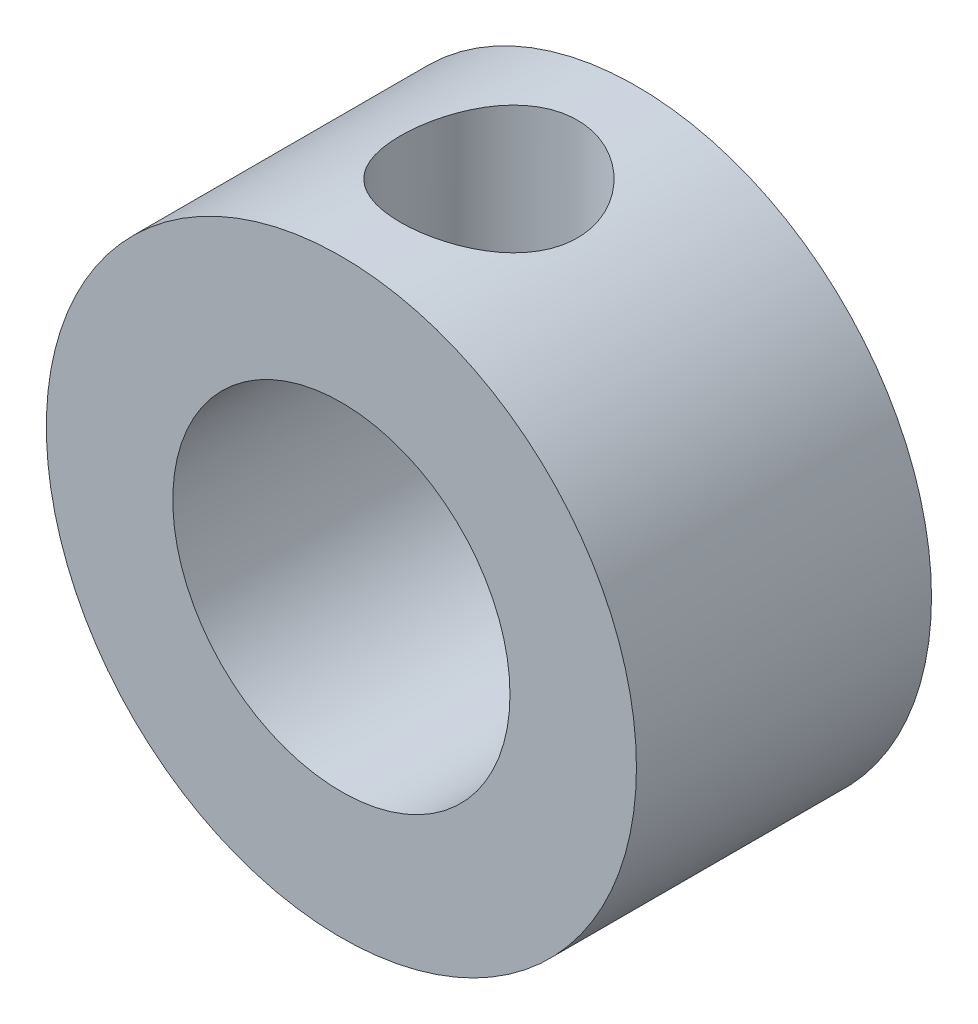
ISO-10303-21;
HEADER;
FILE_DESCRIPTION(('STEP AP214'),'2;1');
FILE_NAME('part.step','',(''),(''),'','','');
FILE_SCHEMA(('AUTOMOTIVE_DESIGN { 1 0 10303 214 1 1 1 1 }'));
ENDSEC;
DATA;
#1=APPLICATION_CONTEXT('core data for automotive mechanical design processes');
#2=APPLICATION_PROTOCOL_DEFINITION('international standard','automotive_design',2000,#1);
#3=PRODUCT_CONTEXT('',#1,'mechanical');
#4=PRODUCT('Part','Part','',(#3));
#5=PRODUCT_RELATED_PRODUCT_CATEGORY('part','',(#4));
#6=PRODUCT_DEFINITION_FORMATION('','',#4);
#7=PRODUCT_DEFINITION_CONTEXT('part definition',#1,'design');
#8=PRODUCT_DEFINITION('design','',#6,#7);
#9=PRODUCT_DEFINITION_SHAPE('','',#8);
#10=(LENGTH_UNIT() NAMED_UNIT(*) SI_UNIT(.MILLI.,.METRE.));
#11=(NAMED_UNIT(*) PLANE_ANGLE_UNIT() SI_UNIT($,.RADIAN.));
#12=(NAMED_UNIT(*) SI_UNIT($,.STERADIAN.) SOLID_ANGLE_UNIT());
#13=UNCERTAINTY_MEASURE_WITH_UNIT(LENGTH_MEASURE(1.E-05),#10,'distance_accuracy_value','');
#14=(GEOMETRIC_REPRESENTATION_CONTEXT(3) GLOBAL_UNCERTAINTY_ASSIGNED_CONTEXT((#13)) GLOBAL_UNIT_ASSIGNED_CONTEXT((#10,
#11,#12)) REPRESENTATION_CONTEXT('',''));
#15=CARTESIAN_POINT('',(0.,0.,0.));
#16=DIRECTION('',(0.,0.,1.));
#17=DIRECTION('',(1.,0.,0.));
#18=AXIS2_PLACEMENT_3D('',#15,#16,#17);
#19=CARTESIAN_POINT('',(0.,0.,7.));
#20=DIRECTION('',(0.,0.,1.));
#21=DIRECTION('',(1.,0.,0.));
#22=AXIS2_PLACEMENT_3D('',#19,#20,#21);
#23=PLANE('',#22);
#24=CARTESIAN_POINT('',(0.,0.,7.));
#25=DIRECTION('',(0.,0.,1.));
#26=DIRECTION('',(1.,0.,0.));
#27=AXIS2_PLACEMENT_3D('',#24,#25,#26);
#28=CIRCLE('',#27,7.);
#29=CARTESIAN_POINT('',(7.,0.,7.));
#30=VERTEX_POINT('',#29);
#31=EDGE_CURVE('E10',#30,#30,#28,.T.);
#32=ORIENTED_EDGE('',*,*,#31,.T.);
#33=EDGE_LOOP('',(#32));
#34=FACE_BOUND('',#33,.T.);
#35=CARTESIAN_POINT('',(0.,0.,7.));
#36=DIRECTION('',(0.,0.,1.));
#37=DIRECTION('',(1.,0.,0.));
#38=AXIS2_PLACEMENT_3D('',#35,#36,#37);
#39=CIRCLE('',#38,4.);
#40=CARTESIAN_POINT('',(4.,0.,7.));
#41=VERTEX_POINT('',#40);
#42=EDGE_CURVE('E48',#41,#41,#39,.T.);
#43=ORIENTED_EDGE('',*,*,#42,.F.);
#44=EDGE_LOOP('',(#43));
#45=FACE_BOUND('',#44,.T.);
#46=ADVANCED_FACE('F36',(#34,#45),#23,.T.);
#47=CARTESIAN_POINT('',(0.,0.,0.));
#48=DIRECTION('',(0.,0.,1.));
#49=DIRECTION('',(1.,0.,0.));
#50=AXIS2_PLACEMENT_3D('',#47,#48,#49);
#51=PLANE('',#50);
#52=CARTESIAN_POINT('',(0.,0.,0.));
#53=DIRECTION('',(0.,0.,1.));
#54=DIRECTION('',(1.,0.,0.));
#55=AXIS2_PLACEMENT_3D('',#52,#53,#54);
#56=CIRCLE('',#55,7.);
#57=CARTESIAN_POINT('',(7.,0.,0.));
#58=VERTEX_POINT('',#57);
#59=EDGE_CURVE('E41',#58,#58,#56,.T.);
#60=ORIENTED_EDGE('',*,*,#59,.F.);
#61=EDGE_LOOP('',(#60));
#62=FACE_BOUND('',#61,.T.);
#63=CARTESIAN_POINT('',(0.,0.,0.));
#64=DIRECTION('',(0.,0.,1.));
#65=DIRECTION('',(1.,0.,0.));
#66=AXIS2_PLACEMENT_3D('',#63,#64,#65);
#67=CIRCLE('',#66,4.);
#68=CARTESIAN_POINT('',(4.,0.,0.));
#69=VERTEX_POINT('',#68);
#70=EDGE_CURVE('E50',#69,#69,#67,.T.);
#71=ORIENTED_EDGE('',*,*,#70,.T.);
#72=EDGE_LOOP('',(#71));
#73=FACE_BOUND('',#72,.T.);
#74=ADVANCED_FACE('F79',(#62,#73),#51,.F.);
#75=CARTESIAN_POINT('',(0.,0.,7.));
#76=DIRECTION('',(0.,0.,-1.));
#77=DIRECTION('',(-1.,0.,0.));
#78=AXIS2_PLACEMENT_3D('',#75,#76,#77);
#79=CYLINDRICAL_SURFACE('',#78,7.);
#80=CARTESIAN_POINT('',(0.,7.,5.59999999999999));
#81=CARTESIAN_POINT('',(-0.115204057854619,6.9999990095077,5.59999860352115));
#82=CARTESIAN_POINT('',(-0.23042224569214,6.99712881971535,5.59048859092644));
#83=CARTESIAN_POINT('',(-0.457503375426832,6.98595947831167,5.55279010408905));
#84=CARTESIAN_POINT('',(-0.569365306175986,6.97765870745569,5.52459605876731));
#85=CARTESIAN_POINT('',(-0.786425790856335,6.95653773502571,5.45055557632562));
#86=CARTESIAN_POINT('',(-0.89163391015352,6.94372420350596,5.40473518253348));
#87=CARTESIAN_POINT('',(-1.09287385347438,6.91490952932704,5.29684946972182));
#88=CARTESIAN_POINT('',(-1.18890445445753,6.89890796268893,5.23478198964641));
#89=CARTESIAN_POINT('',(-1.37182051605724,6.86491032069884,5.09428638953826));
#90=CARTESIAN_POINT('',(-1.45840529974207,6.84687337119851,5.01547672375972));
#91=CARTESIAN_POINT('',(-1.61734889292653,6.81108167894619,4.84454707812574));
#92=CARTESIAN_POINT('',(-1.68970530858417,6.79332698414302,4.75242486302505));
#93=CARTESIAN_POINT('',(-1.8197205281319,6.75967759591281,4.55494094574734));
#94=CARTESIAN_POINT('',(-1.87701232631098,6.74383369329425,4.44932815461296));
#95=CARTESIAN_POINT('',(-1.97289952684664,6.71641068551644,4.22941504407759));
#96=CARTESIAN_POINT('',(-2.01149941887962,6.70483055638635,4.11511681850083));
#97=CARTESIAN_POINT('',(-2.06782287155712,6.68767219173808,3.88445362741736));
#98=CARTESIAN_POINT('',(-2.08610074728548,6.68193497054347,3.76823615859048));
#99=CARTESIAN_POINT('',(-2.1029922286054,6.67663905649674,3.53425358129653));
#100=CARTESIAN_POINT('',(-2.10161059865509,6.677078866648,3.41648885471728));
#101=CARTESIAN_POINT('',(-2.07965768079736,6.68394641694889,3.18726252794812));
#102=CARTESIAN_POINT('',(-2.05978087367759,6.69015744038797,3.07572684949287));
#103=CARTESIAN_POINT('',(-2.00252388597878,6.70751698720074,2.85765229921716));
#104=CARTESIAN_POINT('',(-1.96514197798297,6.71866599785291,2.75111392167594));
#105=CARTESIAN_POINT('',(-1.87342437315154,6.74481826304963,2.54435951047497));
#106=CARTESIAN_POINT('',(-1.81886343708499,6.75987222562333,2.44425008246264));
#107=CARTESIAN_POINT('',(-1.69449311624156,6.7921138180009,2.25437516918573));
#108=CARTESIAN_POINT('',(-1.62468003603623,6.80930196445788,2.16461219882071));
#109=CARTESIAN_POINT('',(-1.46833807071764,6.84475415817112,1.99403933293317));
#110=CARTESIAN_POINT('',(-1.38123287045376,6.86303316034697,1.91375987035847));
#111=CARTESIAN_POINT('',(-1.19456856303955,6.89797141688562,1.76882442231006));
#112=CARTESIAN_POINT('',(-1.09500867260524,6.91463056925774,1.70416942021981));
#113=CARTESIAN_POINT('',(-0.885297053679921,6.94460424097259,1.59199610854938));
#114=CARTESIAN_POINT('',(-0.775078849647127,6.9578956113564,1.5445954772502));
#115=CARTESIAN_POINT('',(-0.547743581844925,6.97946930565111,1.46916057386052));
#116=CARTESIAN_POINT('',(-0.430628452225412,6.98775302661799,1.44112090005452));
#117=CARTESIAN_POINT('',(-0.197333139735663,6.99815710500954,1.40608695094086));
#118=CARTESIAN_POINT('',(-0.0812701366416606,7.00048790584906,1.39837377987775));
#119=CARTESIAN_POINT('',(0.150499448152737,6.99934092538464,1.40219681799692));
#120=CARTESIAN_POINT('',(0.266206075367093,6.9958639194886,1.41373045751203));
#121=CARTESIAN_POINT('',(0.491265047433575,6.98362975782027,1.4551384555561));
#122=CARTESIAN_POINT('',(0.600701881659836,6.9749936171918,1.48459274261322));
#123=CARTESIAN_POINT('',(0.813056494536329,6.95344086978149,1.56050052588949));
#124=CARTESIAN_POINT('',(0.915973487835815,6.94052374849531,1.60695606545301));
#125=CARTESIAN_POINT('',(1.11501206524547,6.91137516091842,1.71675443167359));
#126=CARTESIAN_POINT('',(1.21092135667953,6.89507393161496,1.78046307732718));
#127=CARTESIAN_POINT('',(1.3909326311722,6.86102856270093,1.92251465567393));
#128=CARTESIAN_POINT('',(1.47503164529831,6.84328406203694,2.00086125664271));
#129=CARTESIAN_POINT('',(1.63220042371436,6.80754440616605,2.17334223171712));
#130=CARTESIAN_POINT('',(1.704758737241,6.78956355045859,2.26794662608056));
#131=CARTESIAN_POINT('',(1.83300593101018,6.75607121334564,2.46837911461882));
#132=CARTESIAN_POINT('',(1.88869525361275,6.74055966719185,2.57420691438104));
#133=CARTESIAN_POINT('',(1.9812428597802,6.71394065458417,2.79374548775703));
#134=CARTESIAN_POINT('',(2.01818885711814,6.70281272971451,2.90741666115297));
#135=CARTESIAN_POINT('',(2.07230423141214,6.68628232117816,3.13976315650233));
#136=CARTESIAN_POINT('',(2.08948038570493,6.68087787548571,3.25843674909625));
#137=CARTESIAN_POINT('',(2.1031077827895,6.67659961459091,3.49210612574379));
#138=CARTESIAN_POINT('',(2.1003927743112,6.67746306290276,3.60704911146919));
#139=CARTESIAN_POINT('',(2.07630507622027,6.68499161674532,3.83475974476086));
#140=CARTESIAN_POINT('',(2.05493313374585,6.69165648995131,3.94752747925272));
#141=CARTESIAN_POINT('',(1.9946764432608,6.7098606917247,4.16632355878434));
#142=CARTESIAN_POINT('',(1.95601245709973,6.72133846373454,4.27241820230217));
#143=CARTESIAN_POINT('',(1.86244109969503,6.74786390463686,4.47669941434901));
#144=CARTESIAN_POINT('',(1.80753061948005,6.76291225669556,4.5748844646982));
#145=CARTESIAN_POINT('',(1.68068269327122,6.79556746998737,4.76442836313677));
#146=CARTESIAN_POINT('',(1.60819786530197,6.81324756230006,4.85540826576426));
#147=CARTESIAN_POINT('',(1.44924408481688,6.84881848629347,5.02418349763132));
#148=CARTESIAN_POINT('',(1.36277150398828,6.8667093715328,5.10197539525494));
#149=CARTESIAN_POINT('',(1.17525206705656,6.90131311199101,5.24443277721295));
#150=CARTESIAN_POINT('',(1.07385304010685,6.91797623671995,5.30864802559766));
#151=CARTESIAN_POINT('',(0.861197923576932,6.94764952638087,5.41902923786565));
#152=CARTESIAN_POINT('',(0.749946474198531,6.9606613990348,5.46520364358431));
#153=CARTESIAN_POINT('',(0.533060797717391,6.98043044957033,5.53405338591384));
#154=CARTESIAN_POINT('',(0.428101746735925,6.98770838333498,5.55871634203654));
#155=CARTESIAN_POINT('',(0.215432273323089,6.99749322292286,5.5916889353382));
#156=CARTESIAN_POINT('',(0.107722313801395,7.00000092616635,5.60000130578674));
#157=CARTESIAN_POINT('',(0.,7.,5.59999999999999));
#158=B_SPLINE_CURVE_WITH_KNOTS('',3,(#80,#81,#82,#83,#84,#85,#86,#87,#88,#89,#90,#91,#92,#93,
#94,#95,#96,#97,#98,#99,#100,#101,#102,#103,#104,#105,#106,#107,#108,#109,#110,#111,#112,#113,
#114,#115,#116,#117,#118,#119,#120,#121,#122,#123,#124,#125,#126,#127,#128,#129,#130,#131,#132,
#133,#134,#135,#136,#137,#138,#139,#140,#141,#142,#143,#144,#145,#146,#147,#148,#149,#150,#151,
#152,#153,#154,#155,#156,#157),.UNSPECIFIED.,.T.,.F.,(4,2,2,2,2,2,2,2,2,2,2,2,2,2,2,2,2,2,2,2,2,
2,2,2,2,2,2,2,2,2,2,2,2,2,2,2,2,2,4),(0.,0.345216485057654,0.690535950784397,1.03534714682122,
1.38020423017778,1.73397844127468,2.08781212204086,2.44960073405752,2.81130240360512,
3.16287565099237,3.51436369646724,3.85316423376745,4.191998211212,4.53547397025966,
4.87903304221976,5.23693945667431,5.59486839143498,5.95519465634362,6.31542034940329,
6.66272333213961,7.00997994970455,7.34939445355255,7.68884976431217,8.03615827984069,
8.38355394800265,8.74356560451943,9.1035678195375,9.46186940931749,9.82004813244393,
10.1633021765698,10.5065424753262,10.8455205657019,11.1845635658073,11.5359569595828,
11.8874416486288,12.2492019462572,12.6107927623971,12.9336436870902,13.256440637348),.UNSPECIFIED.);
#159=CARTESIAN_POINT('',(0.,7.,5.59999999999999));
#160=VERTEX_POINT('',#159);
#161=EDGE_CURVE('E53',#160,#160,#158,.T.);
#162=ORIENTED_EDGE('',*,*,#161,.T.);
#163=EDGE_LOOP('',(#162));
#164=FACE_BOUND('',#163,.T.);
#165=ORIENTED_EDGE('',*,*,#31,.F.);
#166=EDGE_LOOP('',(#165));
#167=FACE_BOUND('',#166,.T.);
#168=ORIENTED_EDGE('',*,*,#59,.T.);
#169=EDGE_LOOP('',(#168));
#170=FACE_BOUND('',#169,.T.);
#171=ADVANCED_FACE('F38',(#164,#167,#170),#79,.T.);
#172=CARTESIAN_POINT('',(0.,0.,7.));
#173=DIRECTION('',(0.,0.,-1.));
#174=DIRECTION('',(-1.,0.,0.));
#175=AXIS2_PLACEMENT_3D('',#172,#173,#174);
#176=CYLINDRICAL_SURFACE('',#175,4.);
#177=CARTESIAN_POINT('',(0.,4.,5.59999999999999));
#178=CARTESIAN_POINT('',(-0.109725239522176,3.99999264287857,5.59999149182402));
#179=CARTESIAN_POINT('',(-0.219566121797986,3.99543735627817,5.59134922217853));
#180=CARTESIAN_POINT('',(-0.435956332853302,3.97766056559727,5.55717948516371));
#181=CARTESIAN_POINT('',(-0.542499967026169,3.96442485872988,5.53162434455592));
#182=CARTESIAN_POINT('',(-0.748847767256636,3.93066356262107,5.46492682041998));
#183=CARTESIAN_POINT('',(-0.848677088492019,3.91016722161181,5.42384693196482));
#184=CARTESIAN_POINT('',(-1.0398542926017,3.86372814833453,5.32761268027));
#185=CARTESIAN_POINT('',(-1.13120230734359,3.83778550076629,5.27245853590725));
#186=CARTESIAN_POINT('',(-1.30947182891695,3.78081963010103,5.14560480379001));
#187=CARTESIAN_POINT('',(-1.39572427915895,3.7495762633363,5.07306544943579));
#188=CARTESIAN_POINT('',(-1.55546505007128,3.68618069665244,4.91532568390628));
#189=CARTESIAN_POINT('',(-1.62894256542358,3.65402775386038,4.83011466668523));
#190=CARTESIAN_POINT('',(-1.76753210720386,3.58917602274785,4.64052416418153));
#191=CARTESIAN_POINT('',(-1.83134596949795,3.55667651133239,4.53511911137416));
#192=CARTESIAN_POINT('',(-1.940078009522,3.49855992208216,4.31322101259495));
#193=CARTESIAN_POINT('',(-1.98501055983617,3.47293761465966,4.19673648353417));
#194=CARTESIAN_POINT('',(-2.05162778973322,3.43398312295477,3.9632691019904));
#195=CARTESIAN_POINT('',(-2.07458133375183,3.41998733122417,3.84676509569801));
#196=CARTESIAN_POINT('',(-2.10042065774089,3.40418721984817,3.61079196134464));
#197=CARTESIAN_POINT('',(-2.10333025607271,3.40236843025802,3.49132652193647));
#198=CARTESIAN_POINT('',(-2.08992575686747,3.41060563138389,3.27023585900601));
#199=CARTESIAN_POINT('',(-2.07615752002025,3.4190893964975,3.16838235315366));
#200=CARTESIAN_POINT('',(-2.03424482005422,3.44418916575293,2.96871985136041));
#201=CARTESIAN_POINT('',(-2.00609491145431,3.46080825015501,2.87091240259461));
#202=CARTESIAN_POINT('',(-1.93576201725034,3.50064017337879,2.67933944133553));
#203=CARTESIAN_POINT('',(-1.89327386515966,3.52399463994301,2.58571682638858));
#204=CARTESIAN_POINT('',(-1.79571666755297,3.57469177714186,2.40646125445991));
#205=CARTESIAN_POINT('',(-1.74064200304352,3.60203622704668,2.32083189002303));
#206=CARTESIAN_POINT('',(-1.61039398180521,3.66230444404028,2.14721957759017));
#207=CARTESIAN_POINT('',(-1.53347842501707,3.69546972830905,2.0606227305343));
#208=CARTESIAN_POINT('',(-1.36616462781175,3.76053926987168,1.90094507949335));
#209=CARTESIAN_POINT('',(-1.27575868558247,3.79244279356364,1.82787205014572));
#210=CARTESIAN_POINT('',(-1.07766804032998,3.85356353260701,1.69341787931535));
#211=CARTESIAN_POINT('',(-0.969298919443496,3.88252998474475,1.63292153118831));
#212=CARTESIAN_POINT('',(-0.742023442184859,3.93228772595726,1.53153732928501));
#213=CARTESIAN_POINT('',(-0.623126340783865,3.95308610970455,1.4906324518135));
#214=CARTESIAN_POINT('',(-0.389396974626688,3.9825873442618,1.43322732089386));
#215=CARTESIAN_POINT('',(-0.275130823094222,3.99219507728301,1.4148930907168));
#216=CARTESIAN_POINT('',(-0.0447608666750918,4.00140669767392,1.39730685099086));
#217=CARTESIAN_POINT('',(0.0713418920739022,4.00101608864393,1.39804434338993));
#218=CARTESIAN_POINT('',(0.291279078552977,3.99076728683619,1.41762725788288));
#219=CARTESIAN_POINT('',(0.395299675486035,3.98173859499713,1.43488622954968));
#220=CARTESIAN_POINT('',(0.59872818219623,3.95626547527309,1.4844387504391));
#221=CARTESIAN_POINT('',(0.69813560404272,3.93982026491349,1.51673388605335));
#222=CARTESIAN_POINT('',(0.892553327327724,3.90044221082327,1.59614425381874));
#223=CARTESIAN_POINT('',(0.987382033379108,3.87735176388228,1.64362307426732));
#224=CARTESIAN_POINT('',(1.16801156602731,3.82682103032807,1.75161917503483));
#225=CARTESIAN_POINT('',(1.25380875133066,3.79937900035166,1.81214168451701));
#226=CARTESIAN_POINT('',(1.42355402164766,3.73930849945052,1.95183455389138));
#227=CARTESIAN_POINT('',(1.50635375236175,3.70643824529688,2.03229813881506));
#228=CARTESIAN_POINT('',(1.65784945462857,3.64120206418591,2.20585137885724));
#229=CARTESIAN_POINT('',(1.72653319455466,3.60883659688132,2.298951868959));
#230=CARTESIAN_POINT('',(1.85197407713202,3.54618291275876,2.50233559015912));
#231=CARTESIAN_POINT('',(1.907720584217,3.51615003477916,2.61332823562711));
#232=CARTESIAN_POINT('',(1.99916377433975,3.46498558301669,2.84516122596434));
#233=CARTESIAN_POINT('',(2.03488847416354,3.44384158132139,2.96598753776114));
#234=CARTESIAN_POINT('',(2.08179228794019,3.41567335738197,3.20149049526115));
#235=CARTESIAN_POINT('',(2.09503212797938,3.4074693970288,3.31561103123257));
#236=CARTESIAN_POINT('',(2.10264402498694,3.40278132518373,3.54469308443814));
#237=CARTESIAN_POINT('',(2.09702755352025,3.40629008804561,3.6596540479175));
#238=CARTESIAN_POINT('',(2.06905731966412,3.42333280060867,3.87316961432223));
#239=CARTESIAN_POINT('',(2.04869586578453,3.4356715106149,3.97209433551285));
#240=CARTESIAN_POINT('',(1.99445953447468,3.4674360798436,4.16496081401225));
#241=CARTESIAN_POINT('',(1.96057985676336,3.48686445637592,4.25890078781238));
#242=CARTESIAN_POINT('',(1.8778270800915,3.53215539501753,4.44599660125697));
#243=CARTESIAN_POINT('',(1.82811697206111,3.55835615136984,4.53869769157733));
#244=CARTESIAN_POINT('',(1.71597189148521,3.61377283019222,4.71506230921822));
#245=CARTESIAN_POINT('',(1.65353007488422,3.64299037017672,4.79872093850826));
#246=CARTESIAN_POINT('',(1.50756499361577,3.7059946066124,4.96672364713411));
#247=CARTESIAN_POINT('',(1.42231898680451,3.73985298438168,5.04955350976633));
#248=CARTESIAN_POINT('',(1.2383912708079,3.80472261290781,5.20015739194561));
#249=CARTESIAN_POINT('',(1.13970134446325,3.83573210281286,5.26792213623382));
#250=CARTESIAN_POINT('',(0.928722586410789,3.89224463430732,5.38743364904117));
#251=CARTESIAN_POINT('',(0.816206474636302,3.91762876470986,5.43884301060635));
#252=CARTESIAN_POINT('',(0.641101799511677,3.94873745727715,5.50070791315573));
#253=CARTESIAN_POINT('',(0.581718321049471,3.95794212176884,5.51878135698884));
#254=CARTESIAN_POINT('',(0.461272845180562,3.97377707651405,5.54965439112677));
#255=CARTESIAN_POINT('',(0.400211824286285,3.98040883184999,5.56245698304871));
#256=CARTESIAN_POINT('',(0.282777177199966,3.99038534961525,5.58164251076547));
#257=CARTESIAN_POINT('',(0.226504746010371,3.99398117175069,5.58851710911177));
#258=CARTESIAN_POINT('',(0.113498532604898,3.99879042332403,5.59769809925702));
#259=CARTESIAN_POINT('',(0.0567647413745303,4.00000380609873,5.60000440157989));
#260=CARTESIAN_POINT('',(0.,4.,5.59999999999999));
#261=B_SPLINE_CURVE_WITH_KNOTS('',3,(#177,#178,#179,#180,#181,#182,#183,#184,#185,#186,#187,
#188,#189,#190,#191,#192,#193,#194,#195,#196,#197,#198,#199,#200,#201,#202,#203,#204,#205,#206,
#207,#208,#209,#210,#211,#212,#213,#214,#215,#216,#217,#218,#219,#220,#221,#222,#223,#224,#225,
#226,#227,#228,#229,#230,#231,#232,#233,#234,#235,#236,#237,#238,#239,#240,#241,#242,#243,#244,
#245,#246,#247,#248,#249,#250,#251,#252,#253,#254,#255,#256,#257,#258,#259,#260),.UNSPECIFIED.,
.T.,.F.,(4,2,2,2,2,2,2,2,2,2,2,2,2,2,2,2,2,2,2,2,2,2,2,2,2,2,2,2,2,2,2,2,2,2,2,2,2,2,2,2,2,4),
(0.,0.328955388056857,0.658450355809532,0.986632826787795,1.31481019432104,1.66422610127769,
2.01393612903032,2.3943054227538,2.77438464995627,3.13089429519634,3.48698022433371,
3.79492330354658,4.1029830689429,4.41806287071791,4.73328360921355,5.09317488258759,
5.45327241364169,5.83355153918035,6.21349962504737,6.55994297045683,6.90619561978192,
7.2222202700175,7.53827827001647,7.8625561182731,8.18696421086292,8.54557019619713,
8.90448561862084,9.28577946390599,9.66653841880975,10.0100186118085,10.3532898805347,
10.6572136356427,10.9612454093543,11.2851996834104,11.6093285635883,11.9784125341219,
12.347723115996,12.7242211787441,12.9122308814786,13.1001333688401,13.2703102751049,
13.4404905144748),.UNSPECIFIED.);
#262=CARTESIAN_POINT('',(0.,4.,5.59999999999999));
#263=VERTEX_POINT('',#262);
#264=EDGE_CURVE('E62',#263,#263,#261,.T.);
#265=ORIENTED_EDGE('',*,*,#264,.F.);
#266=EDGE_LOOP('',(#265));
#267=FACE_BOUND('',#266,.T.);
#268=ORIENTED_EDGE('',*,*,#42,.T.);
#269=EDGE_LOOP('',(#268));
#270=FACE_BOUND('',#269,.T.);
#271=ORIENTED_EDGE('',*,*,#70,.F.);
#272=EDGE_LOOP('',(#271));
#273=FACE_BOUND('',#272,.T.);
#274=ADVANCED_FACE('F70',(#267,#270,#273),#176,.F.);
#275=CARTESIAN_POINT('',(0.,7.,3.5));
#276=DIRECTION('',(0.,1.,0.));
#277=DIRECTION('',(0.,0.,1.));
#278=AXIS2_PLACEMENT_3D('',#275,#276,#277);
#279=CYLINDRICAL_SURFACE('',#278,2.09999999999999);
#280=ORIENTED_EDGE('',*,*,#264,.T.);
#281=EDGE_LOOP('',(#280));
#282=FACE_BOUND('',#281,.T.);
#283=ORIENTED_EDGE('',*,*,#161,.F.);
#284=EDGE_LOOP('',(#283));
#285=FACE_BOUND('',#284,.T.);
#286=ADVANCED_FACE('F67',(#282,#285),#279,.F.);
#287=CLOSED_SHELL('',(#46,#74,#171,#274,#286));
#288=MANIFOLD_SOLID_BREP('B2',#287);
#289=ADVANCED_BREP_SHAPE_REPRESENTATION('',(#18,#288),#14);
#290=SHAPE_DEFINITION_REPRESENTATION(#9,#289);
ENDSEC;
END-ISO-10303-21;
